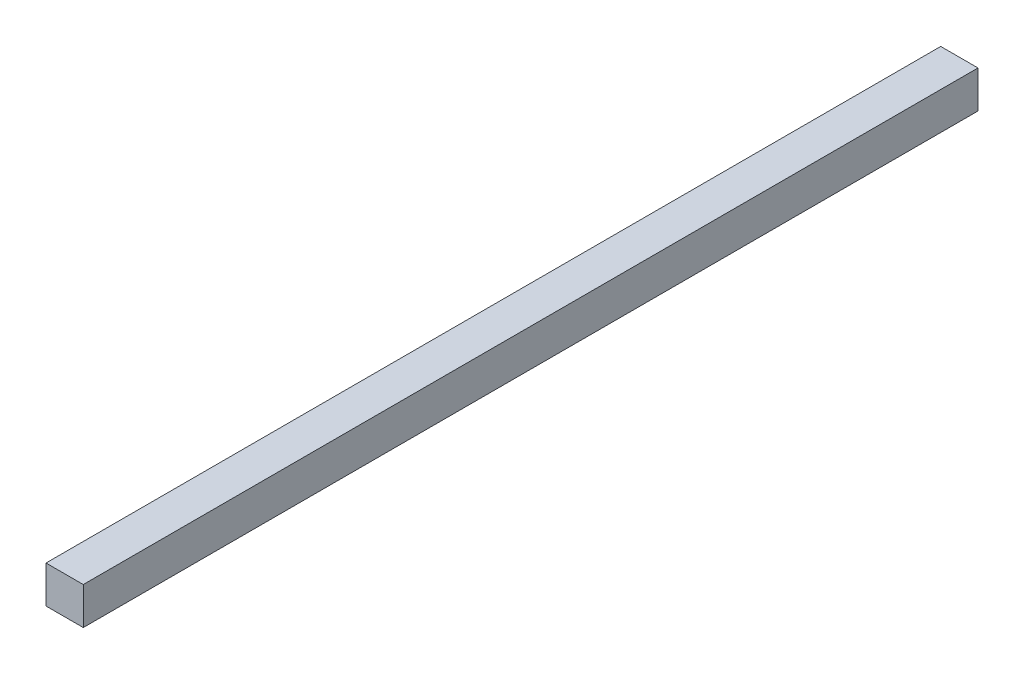
ISO-10303-21;
HEADER;
FILE_DESCRIPTION(('STEP AP214'),'2;1');
FILE_NAME('part.step','',(''),(''),'','','');
FILE_SCHEMA(('AUTOMOTIVE_DESIGN { 1 0 10303 214 1 1 1 1 }'));
ENDSEC;
DATA;
#1=APPLICATION_CONTEXT('core data for automotive mechanical design processes');
#2=APPLICATION_PROTOCOL_DEFINITION('international standard','automotive_design',2000,#1);
#3=PRODUCT_CONTEXT('',#1,'mechanical');
#4=PRODUCT('Part','Part','',(#3));
#5=PRODUCT_RELATED_PRODUCT_CATEGORY('part','',(#4));
#6=PRODUCT_DEFINITION_FORMATION('','',#4);
#7=PRODUCT_DEFINITION_CONTEXT('part definition',#1,'design');
#8=PRODUCT_DEFINITION('design','',#6,#7);
#9=PRODUCT_DEFINITION_SHAPE('','',#8);
#10=(LENGTH_UNIT() NAMED_UNIT(*) SI_UNIT(.MILLI.,.METRE.));
#11=(NAMED_UNIT(*) PLANE_ANGLE_UNIT() SI_UNIT($,.RADIAN.));
#12=(NAMED_UNIT(*) SI_UNIT($,.STERADIAN.) SOLID_ANGLE_UNIT());
#13=UNCERTAINTY_MEASURE_WITH_UNIT(LENGTH_MEASURE(1.E-05),#10,'distance_accuracy_value','');
#14=(GEOMETRIC_REPRESENTATION_CONTEXT(3) GLOBAL_UNCERTAINTY_ASSIGNED_CONTEXT((#13)) GLOBAL_UNIT_ASSIGNED_CONTEXT((#10,
#11,#12)) REPRESENTATION_CONTEXT('',''));
#15=CARTESIAN_POINT('',(0.,0.,0.));
#16=DIRECTION('',(0.,0.,1.));
#17=DIRECTION('',(1.,0.,0.));
#18=AXIS2_PLACEMENT_3D('',#15,#16,#17);
#19=CARTESIAN_POINT('',(0.,25.3999999999999,0.));
#20=DIRECTION('',(0.999999999999997,0.,0.));
#21=DIRECTION('',(0.,0.,-0.999999999999997));
#22=AXIS2_PLACEMENT_3D('',#19,#20,#21);
#23=PLANE('',#22);
#24=DIRECTION('',(0.,0.,0.999999999999997));
#25=VECTOR('',#24,1.);
#26=CARTESIAN_POINT('',(0.,0.,0.));
#27=LINE('',#26,#25);
#28=CARTESIAN_POINT('',(0.,0.,-609.599999999998));
#29=VERTEX_POINT('',#28);
#30=CARTESIAN_POINT('',(0.,0.,0.));
#31=VERTEX_POINT('',#30);
#32=EDGE_CURVE('E97',#29,#31,#27,.T.);
#33=ORIENTED_EDGE('',*,*,#32,.T.);
#34=DIRECTION('',(0.,-1.,0.));
#35=VECTOR('',#34,1.);
#36=CARTESIAN_POINT('',(0.,25.3999999999999,0.));
#37=LINE('',#36,#35);
#38=CARTESIAN_POINT('',(0.,25.3999999999999,0.));
#39=VERTEX_POINT('',#38);
#40=EDGE_CURVE('E11',#39,#31,#37,.T.);
#41=ORIENTED_EDGE('',*,*,#40,.F.);
#42=DIRECTION('',(0.,0.,0.999999999999997));
#43=VECTOR('',#42,1.);
#44=CARTESIAN_POINT('',(0.,25.3999999999999,0.));
#45=LINE('',#44,#43);
#46=CARTESIAN_POINT('',(0.,25.3999999999999,-609.599999999998));
#47=VERTEX_POINT('',#46);
#48=EDGE_CURVE('E85',#47,#39,#45,.T.);
#49=ORIENTED_EDGE('',*,*,#48,.F.);
#50=DIRECTION('',(0.,-1.,0.));
#51=VECTOR('',#50,1.);
#52=CARTESIAN_POINT('',(0.,25.3999999999999,-609.599999999998));
#53=LINE('',#52,#51);
#54=EDGE_CURVE('E93',#47,#29,#53,.T.);
#55=ORIENTED_EDGE('',*,*,#54,.T.);
#56=EDGE_LOOP('',(#33,#41,#49,#55));
#57=FACE_BOUND('',#56,.T.);
#58=ADVANCED_FACE('F34',(#57),#23,.F.);
#59=CARTESIAN_POINT('',(0.,25.3999999999999,0.));
#60=DIRECTION('',(0.,0.,-0.999999999999997));
#61=DIRECTION('',(-0.999999999999997,0.,0.));
#62=AXIS2_PLACEMENT_3D('',#59,#60,#61);
#63=PLANE('',#62);
#64=DIRECTION('',(0.999999999999997,0.,0.));
#65=VECTOR('',#64,1.);
#66=CARTESIAN_POINT('',(0.,0.,0.));
#67=LINE('',#66,#65);
#68=CARTESIAN_POINT('',(25.3999999999999,0.,0.));
#69=VERTEX_POINT('',#68);
#70=EDGE_CURVE('E89',#31,#69,#67,.T.);
#71=ORIENTED_EDGE('',*,*,#70,.T.);
#72=DIRECTION('',(0.,-1.,0.));
#73=VECTOR('',#72,1.);
#74=CARTESIAN_POINT('',(25.3999999999999,25.3999999999999,0.));
#75=LINE('',#74,#73);
#76=CARTESIAN_POINT('',(25.3999999999999,25.3999999999999,0.));
#77=VERTEX_POINT('',#76);
#78=EDGE_CURVE('E42',#77,#69,#75,.T.);
#79=ORIENTED_EDGE('',*,*,#78,.F.);
#80=DIRECTION('',(0.999999999999997,0.,0.));
#81=VECTOR('',#80,1.);
#82=CARTESIAN_POINT('',(0.,25.3999999999999,0.));
#83=LINE('',#82,#81);
#84=EDGE_CURVE('E80',#39,#77,#83,.T.);
#85=ORIENTED_EDGE('',*,*,#84,.F.);
#86=ORIENTED_EDGE('',*,*,#40,.T.);
#87=EDGE_LOOP('',(#71,#79,#85,#86));
#88=FACE_BOUND('',#87,.T.);
#89=ADVANCED_FACE('F88',(#88),#63,.F.);
#90=CARTESIAN_POINT('',(25.3999999999999,25.3999999999999,0.));
#91=DIRECTION('',(-0.999999999999997,0.,0.));
#92=DIRECTION('',(0.,0.,0.999999999999997));
#93=AXIS2_PLACEMENT_3D('',#90,#91,#92);
#94=PLANE('',#93);
#95=DIRECTION('',(0.,0.,-0.999999999999997));
#96=VECTOR('',#95,1.);
#97=CARTESIAN_POINT('',(25.3999999999999,0.,0.));
#98=LINE('',#97,#96);
#99=CARTESIAN_POINT('',(25.3999999999999,0.,-609.599999999998));
#100=VERTEX_POINT('',#99);
#101=EDGE_CURVE('E67',#69,#100,#98,.T.);
#102=ORIENTED_EDGE('',*,*,#101,.T.);
#103=DIRECTION('',(0.,-1.,0.));
#104=VECTOR('',#103,1.);
#105=CARTESIAN_POINT('',(25.3999999999999,25.3999999999999,-609.599999999998));
#106=LINE('',#105,#104);
#107=CARTESIAN_POINT('',(25.3999999999999,25.3999999999999,-609.599999999998));
#108=VERTEX_POINT('',#107);
#109=EDGE_CURVE('E90',#108,#100,#106,.T.);
#110=ORIENTED_EDGE('',*,*,#109,.F.);
#111=DIRECTION('',(0.,0.,-0.999999999999997));
#112=VECTOR('',#111,1.);
#113=CARTESIAN_POINT('',(25.3999999999999,25.3999999999999,0.));
#114=LINE('',#113,#112);
#115=EDGE_CURVE('E83',#77,#108,#114,.T.);
#116=ORIENTED_EDGE('',*,*,#115,.F.);
#117=ORIENTED_EDGE('',*,*,#78,.T.);
#118=EDGE_LOOP('',(#102,#110,#116,#117));
#119=FACE_BOUND('',#118,.T.);
#120=ADVANCED_FACE('F91',(#119),#94,.F.);
#121=CARTESIAN_POINT('',(0.,25.3999999999999,-609.599999999998));
#122=DIRECTION('',(0.,0.,0.999999999999997));
#123=DIRECTION('',(0.999999999999997,0.,0.));
#124=AXIS2_PLACEMENT_3D('',#121,#122,#123);
#125=PLANE('',#124);
#126=DIRECTION('',(-0.999999999999997,0.,0.));
#127=VECTOR('',#126,1.);
#128=CARTESIAN_POINT('',(0.,0.,-609.599999999998));
#129=LINE('',#128,#127);
#130=EDGE_CURVE('E73',#100,#29,#129,.T.);
#131=ORIENTED_EDGE('',*,*,#130,.T.);
#132=ORIENTED_EDGE('',*,*,#54,.F.);
#133=DIRECTION('',(-0.999999999999997,0.,0.));
#134=VECTOR('',#133,1.);
#135=CARTESIAN_POINT('',(0.,25.3999999999999,-609.599999999998));
#136=LINE('',#135,#134);
#137=EDGE_CURVE('E50',#108,#47,#136,.T.);
#138=ORIENTED_EDGE('',*,*,#137,.F.);
#139=ORIENTED_EDGE('',*,*,#109,.T.);
#140=EDGE_LOOP('',(#131,#132,#138,#139));
#141=FACE_BOUND('',#140,.T.);
#142=ADVANCED_FACE('F104',(#141),#125,.F.);
#143=CARTESIAN_POINT('',(0.,25.3999999999999,0.));
#144=DIRECTION('',(0.,-1.,0.));
#145=DIRECTION('',(0.,0.,-0.999999999999997));
#146=AXIS2_PLACEMENT_3D('',#143,#144,#145);
#147=PLANE('',#146);
#148=ORIENTED_EDGE('',*,*,#48,.T.);
#149=ORIENTED_EDGE('',*,*,#84,.T.);
#150=ORIENTED_EDGE('',*,*,#115,.T.);
#151=ORIENTED_EDGE('',*,*,#137,.T.);
#152=EDGE_LOOP('',(#148,#149,#150,#151));
#153=FACE_BOUND('',#152,.T.);
#154=ADVANCED_FACE('F81',(#153),#147,.F.);
#155=CARTESIAN_POINT('',(0.,0.,0.));
#156=DIRECTION('',(0.,-1.,0.));
#157=DIRECTION('',(0.,0.,-0.999999999999997));
#158=AXIS2_PLACEMENT_3D('',#155,#156,#157);
#159=PLANE('',#158);
#160=ORIENTED_EDGE('',*,*,#32,.F.);
#161=ORIENTED_EDGE('',*,*,#130,.F.);
#162=ORIENTED_EDGE('',*,*,#101,.F.);
#163=ORIENTED_EDGE('',*,*,#70,.F.);
#164=EDGE_LOOP('',(#160,#161,#162,#163));
#165=FACE_BOUND('',#164,.T.);
#166=ADVANCED_FACE('F107',(#165),#159,.T.);
#167=CLOSED_SHELL('',(#58,#89,#120,#142,#154,#166));
#168=MANIFOLD_SOLID_BREP('B2',#167);
#169=ADVANCED_BREP_SHAPE_REPRESENTATION('',(#18,#168),#14);
#170=SHAPE_DEFINITION_REPRESENTATION(#9,#169);
ENDSEC;
END-ISO-10303-21;
